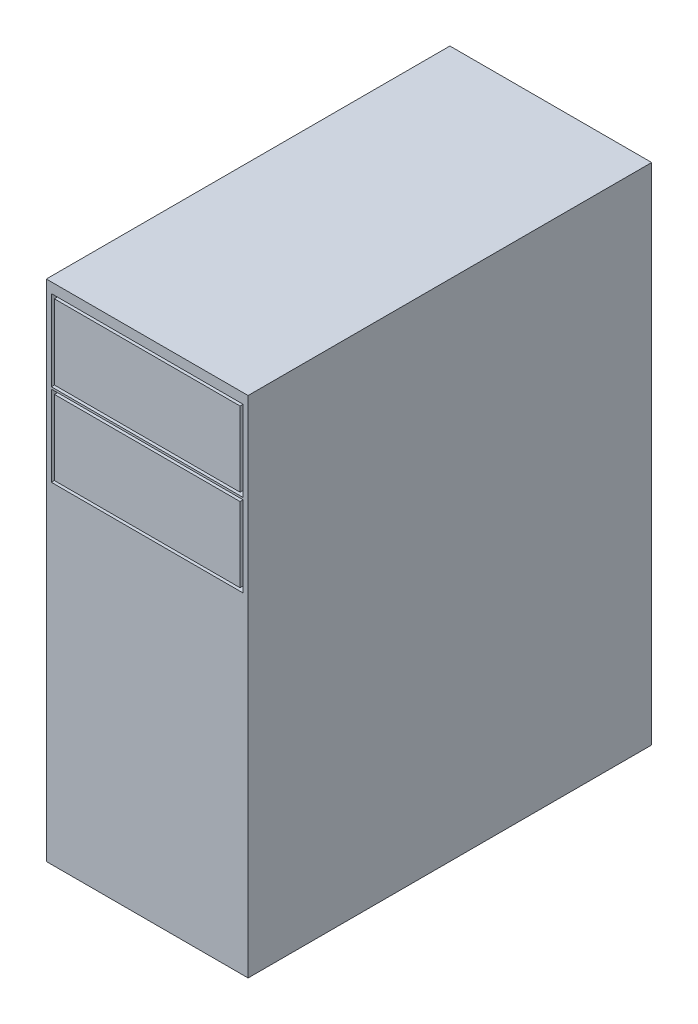
ISO-10303-21;
HEADER;
FILE_DESCRIPTION(('STEP AP214'),'2;1');
FILE_NAME('part.step','',(''),(''),'','','');
FILE_SCHEMA(('AUTOMOTIVE_DESIGN { 1 0 10303 214 1 1 1 1 }'));
ENDSEC;
DATA;
#1=APPLICATION_CONTEXT('core data for automotive mechanical design processes');
#2=APPLICATION_PROTOCOL_DEFINITION('international standard','automotive_design',2000,#1);
#3=PRODUCT_CONTEXT('',#1,'mechanical');
#4=PRODUCT('Part','Part','',(#3));
#5=PRODUCT_RELATED_PRODUCT_CATEGORY('part','',(#4));
#6=PRODUCT_DEFINITION_FORMATION('','',#4);
#7=PRODUCT_DEFINITION_CONTEXT('part definition',#1,'design');
#8=PRODUCT_DEFINITION('design','',#6,#7);
#9=PRODUCT_DEFINITION_SHAPE('','',#8);
#10=(LENGTH_UNIT() NAMED_UNIT(*) SI_UNIT(.MILLI.,.METRE.));
#11=(NAMED_UNIT(*) PLANE_ANGLE_UNIT() SI_UNIT($,.RADIAN.));
#12=(NAMED_UNIT(*) SI_UNIT($,.STERADIAN.) SOLID_ANGLE_UNIT());
#13=UNCERTAINTY_MEASURE_WITH_UNIT(LENGTH_MEASURE(1.E-05),#10,'distance_accuracy_value','');
#14=(GEOMETRIC_REPRESENTATION_CONTEXT(3) GLOBAL_UNCERTAINTY_ASSIGNED_CONTEXT((#13)) GLOBAL_UNIT_ASSIGNED_CONTEXT((#10,
#11,#12)) REPRESENTATION_CONTEXT('',''));
#15=CARTESIAN_POINT('',(0.,0.,0.));
#16=DIRECTION('',(0.,0.,1.));
#17=DIRECTION('',(1.,0.,0.));
#18=AXIS2_PLACEMENT_3D('',#15,#16,#17);
#19=CARTESIAN_POINT('',(25.,125.,-50.));
#20=DIRECTION('',(-1.,0.,0.));
#21=DIRECTION('',(0.,0.,1.));
#22=AXIS2_PLACEMENT_3D('',#19,#20,#21);
#23=PLANE('',#22);
#24=DIRECTION('',(0.,0.,-1.));
#25=VECTOR('',#24,1.);
#26=CARTESIAN_POINT('',(25.,0.,-50.));
#27=LINE('',#26,#25);
#28=CARTESIAN_POINT('',(25.,0.,50.));
#29=VERTEX_POINT('',#28);
#30=CARTESIAN_POINT('',(25.,0.,-50.));
#31=VERTEX_POINT('',#30);
#32=EDGE_CURVE('E240',#29,#31,#27,.T.);
#33=ORIENTED_EDGE('',*,*,#32,.T.);
#34=DIRECTION('',(0.,-1.,0.));
#35=VECTOR('',#34,1.);
#36=CARTESIAN_POINT('',(25.,125.,-50.));
#37=LINE('',#36,#35);
#38=CARTESIAN_POINT('',(25.,125.,-50.));
#39=VERTEX_POINT('',#38);
#40=EDGE_CURVE('E11',#39,#31,#37,.T.);
#41=ORIENTED_EDGE('',*,*,#40,.F.);
#42=DIRECTION('',(0.,0.,-1.));
#43=VECTOR('',#42,1.);
#44=CARTESIAN_POINT('',(25.,125.,-50.));
#45=LINE('',#44,#43);
#46=CARTESIAN_POINT('',(25.,125.,50.));
#47=VERTEX_POINT('',#46);
#48=EDGE_CURVE('E310',#47,#39,#45,.T.);
#49=ORIENTED_EDGE('',*,*,#48,.F.);
#50=DIRECTION('',(0.,-1.,0.));
#51=VECTOR('',#50,1.);
#52=CARTESIAN_POINT('',(25.,125.,50.));
#53=LINE('',#52,#51);
#54=EDGE_CURVE('E320',#47,#29,#53,.T.);
#55=ORIENTED_EDGE('',*,*,#54,.T.);
#56=EDGE_LOOP('',(#33,#41,#49,#55));
#57=FACE_BOUND('',#56,.T.);
#58=ADVANCED_FACE('F37',(#57),#23,.F.);
#59=CARTESIAN_POINT('',(-25.,125.,-50.));
#60=DIRECTION('',(0.,0.,1.));
#61=DIRECTION('',(1.,0.,0.));
#62=AXIS2_PLACEMENT_3D('',#59,#60,#61);
#63=PLANE('',#62);
#64=DIRECTION('',(-1.,0.,0.));
#65=VECTOR('',#64,1.);
#66=CARTESIAN_POINT('',(-25.,0.,-50.));
#67=LINE('',#66,#65);
#68=CARTESIAN_POINT('',(-25.,0.,-50.));
#69=VERTEX_POINT('',#68);
#70=EDGE_CURVE('E323',#31,#69,#67,.T.);
#71=ORIENTED_EDGE('',*,*,#70,.T.);
#72=DIRECTION('',(0.,-1.,0.));
#73=VECTOR('',#72,1.);
#74=CARTESIAN_POINT('',(-25.,125.,-50.));
#75=LINE('',#74,#73);
#76=CARTESIAN_POINT('',(-25.,125.,-50.));
#77=VERTEX_POINT('',#76);
#78=EDGE_CURVE('E44',#77,#69,#75,.T.);
#79=ORIENTED_EDGE('',*,*,#78,.F.);
#80=DIRECTION('',(-1.,0.,0.));
#81=VECTOR('',#80,1.);
#82=CARTESIAN_POINT('',(-25.,125.,-50.));
#83=LINE('',#82,#81);
#84=EDGE_CURVE('E313',#39,#77,#83,.T.);
#85=ORIENTED_EDGE('',*,*,#84,.F.);
#86=ORIENTED_EDGE('',*,*,#40,.T.);
#87=EDGE_LOOP('',(#71,#79,#85,#86));
#88=FACE_BOUND('',#87,.T.);
#89=ADVANCED_FACE('F353',(#88),#63,.F.);
#90=CARTESIAN_POINT('',(-25.,125.,-50.));
#91=DIRECTION('',(1.,0.,0.));
#92=DIRECTION('',(0.,0.,-1.));
#93=AXIS2_PLACEMENT_3D('',#90,#91,#92);
#94=PLANE('',#93);
#95=DIRECTION('',(0.,0.,1.));
#96=VECTOR('',#95,1.);
#97=CARTESIAN_POINT('',(-25.,0.,-50.));
#98=LINE('',#97,#96);
#99=CARTESIAN_POINT('',(-25.,0.,50.));
#100=VERTEX_POINT('',#99);
#101=EDGE_CURVE('E325',#69,#100,#98,.T.);
#102=ORIENTED_EDGE('',*,*,#101,.T.);
#103=DIRECTION('',(0.,-1.,0.));
#104=VECTOR('',#103,1.);
#105=CARTESIAN_POINT('',(-25.,125.,50.));
#106=LINE('',#105,#104);
#107=CARTESIAN_POINT('',(-25.,125.,50.));
#108=VERTEX_POINT('',#107);
#109=EDGE_CURVE('E330',#108,#100,#106,.T.);
#110=ORIENTED_EDGE('',*,*,#109,.F.);
#111=DIRECTION('',(0.,0.,1.));
#112=VECTOR('',#111,1.);
#113=CARTESIAN_POINT('',(-25.,125.,-50.));
#114=LINE('',#113,#112);
#115=EDGE_CURVE('E316',#77,#108,#114,.T.);
#116=ORIENTED_EDGE('',*,*,#115,.F.);
#117=ORIENTED_EDGE('',*,*,#78,.T.);
#118=EDGE_LOOP('',(#102,#110,#116,#117));
#119=FACE_BOUND('',#118,.T.);
#120=ADVANCED_FACE('F337',(#119),#94,.F.);
#121=CARTESIAN_POINT('',(-25.,125.,50.));
#122=DIRECTION('',(0.,0.,-1.));
#123=DIRECTION('',(-1.,0.,0.));
#124=AXIS2_PLACEMENT_3D('',#121,#122,#123);
#125=PLANE('',#124);
#126=DIRECTION('',(-1.,0.,0.));
#127=VECTOR('',#126,1.);
#128=CARTESIAN_POINT('',(-23.75,122.5,50.));
#129=LINE('',#128,#127);
#130=CARTESIAN_POINT('',(23.75,122.5,50.));
#131=VERTEX_POINT('',#130);
#132=CARTESIAN_POINT('',(-23.75,122.5,50.));
#133=VERTEX_POINT('',#132);
#134=EDGE_CURVE('E230',#131,#133,#129,.T.);
#135=ORIENTED_EDGE('',*,*,#134,.F.);
#136=DIRECTION('',(0.,1.,0.));
#137=VECTOR('',#136,1.);
#138=CARTESIAN_POINT('',(23.75,122.5,50.));
#139=LINE('',#138,#137);
#140=CARTESIAN_POINT('',(23.75,102.5,50.));
#141=VERTEX_POINT('',#140);
#142=EDGE_CURVE('E51',#141,#131,#139,.T.);
#143=ORIENTED_EDGE('',*,*,#142,.F.);
#144=DIRECTION('',(1.,0.,0.));
#145=VECTOR('',#144,1.);
#146=CARTESIAN_POINT('',(-23.75,102.5,50.));
#147=LINE('',#146,#145);
#148=CARTESIAN_POINT('',(-23.75,102.5,50.));
#149=VERTEX_POINT('',#148);
#150=EDGE_CURVE('E219',#149,#141,#147,.T.);
#151=ORIENTED_EDGE('',*,*,#150,.F.);
#152=DIRECTION('',(0.,-1.,0.));
#153=VECTOR('',#152,1.);
#154=CARTESIAN_POINT('',(-23.75,122.5,50.));
#155=LINE('',#154,#153);
#156=EDGE_CURVE('E233',#133,#149,#155,.T.);
#157=ORIENTED_EDGE('',*,*,#156,.F.);
#158=EDGE_LOOP('',(#135,#143,#151,#157));
#159=FACE_BOUND('',#158,.T.);
#160=DIRECTION('',(-1.,0.,0.));
#161=VECTOR('',#160,1.);
#162=CARTESIAN_POINT('',(-23.7499999999998,102.,50.));
#163=LINE('',#162,#161);
#164=CARTESIAN_POINT('',(23.7500000000002,102.,50.));
#165=VERTEX_POINT('',#164);
#166=CARTESIAN_POINT('',(-23.7499999999998,102.,50.));
#167=VERTEX_POINT('',#166);
#168=EDGE_CURVE('E295',#165,#167,#163,.T.);
#169=ORIENTED_EDGE('',*,*,#168,.F.);
#170=DIRECTION('',(0.,1.,0.));
#171=VECTOR('',#170,1.);
#172=CARTESIAN_POINT('',(23.7500000000002,102.,50.));
#173=LINE('',#172,#171);
#174=CARTESIAN_POINT('',(23.7500000000002,82.,50.));
#175=VERTEX_POINT('',#174);
#176=EDGE_CURVE('E273',#175,#165,#173,.T.);
#177=ORIENTED_EDGE('',*,*,#176,.F.);
#178=DIRECTION('',(1.,0.,0.));
#179=VECTOR('',#178,1.);
#180=CARTESIAN_POINT('',(-23.7499999999998,82.,50.));
#181=LINE('',#180,#179);
#182=CARTESIAN_POINT('',(-23.7499999999998,82.,50.));
#183=VERTEX_POINT('',#182);
#184=EDGE_CURVE('E284',#183,#175,#181,.T.);
#185=ORIENTED_EDGE('',*,*,#184,.F.);
#186=DIRECTION('',(0.,-1.,0.));
#187=VECTOR('',#186,1.);
#188=CARTESIAN_POINT('',(-23.7499999999998,102.,50.));
#189=LINE('',#188,#187);
#190=EDGE_CURVE('E298',#167,#183,#189,.T.);
#191=ORIENTED_EDGE('',*,*,#190,.F.);
#192=EDGE_LOOP('',(#169,#177,#185,#191));
#193=FACE_BOUND('',#192,.T.);
#194=DIRECTION('',(1.,0.,0.));
#195=VECTOR('',#194,1.);
#196=CARTESIAN_POINT('',(-25.,0.,50.));
#197=LINE('',#196,#195);
#198=EDGE_CURVE('E314',#100,#29,#197,.T.);
#199=ORIENTED_EDGE('',*,*,#198,.T.);
#200=ORIENTED_EDGE('',*,*,#54,.F.);
#201=DIRECTION('',(1.,0.,0.));
#202=VECTOR('',#201,1.);
#203=CARTESIAN_POINT('',(-25.,125.,50.));
#204=LINE('',#203,#202);
#205=EDGE_CURVE('E318',#108,#47,#204,.T.);
#206=ORIENTED_EDGE('',*,*,#205,.F.);
#207=ORIENTED_EDGE('',*,*,#109,.T.);
#208=EDGE_LOOP('',(#199,#200,#206,#207));
#209=FACE_BOUND('',#208,.T.);
#210=ADVANCED_FACE('F346',(#159,#193,#209),#125,.F.);
#211=CARTESIAN_POINT('',(0.,125.,0.));
#212=DIRECTION('',(0.,1.,0.));
#213=DIRECTION('',(0.,0.,1.));
#214=AXIS2_PLACEMENT_3D('',#211,#212,#213);
#215=PLANE('',#214);
#216=ORIENTED_EDGE('',*,*,#48,.T.);
#217=ORIENTED_EDGE('',*,*,#84,.T.);
#218=ORIENTED_EDGE('',*,*,#115,.T.);
#219=ORIENTED_EDGE('',*,*,#205,.T.);
#220=EDGE_LOOP('',(#216,#217,#218,#219));
#221=FACE_BOUND('',#220,.T.);
#222=ADVANCED_FACE('F352',(#221),#215,.T.);
#223=CARTESIAN_POINT('',(0.,0.,0.));
#224=DIRECTION('',(0.,1.,0.));
#225=DIRECTION('',(0.,0.,1.));
#226=AXIS2_PLACEMENT_3D('',#223,#224,#225);
#227=PLANE('',#226);
#228=ORIENTED_EDGE('',*,*,#32,.F.);
#229=ORIENTED_EDGE('',*,*,#198,.F.);
#230=ORIENTED_EDGE('',*,*,#101,.F.);
#231=ORIENTED_EDGE('',*,*,#70,.F.);
#232=EDGE_LOOP('',(#228,#229,#230,#231));
#233=FACE_BOUND('',#232,.T.);
#234=ADVANCED_FACE('F343',(#233),#227,.F.);
#235=CARTESIAN_POINT('',(23.7500000000002,102.,48.));
#236=DIRECTION('',(1.,0.,0.));
#237=DIRECTION('',(0.,1.,0.));
#238=AXIS2_PLACEMENT_3D('',#235,#236,#237);
#239=PLANE('',#238);
#240=ORIENTED_EDGE('',*,*,#176,.T.);
#241=DIRECTION('',(0.,0.,1.));
#242=VECTOR('',#241,1.);
#243=CARTESIAN_POINT('',(23.7500000000002,102.,48.));
#244=LINE('',#243,#242);
#245=CARTESIAN_POINT('',(23.7500000000002,102.,48.));
#246=VERTEX_POINT('',#245);
#247=EDGE_CURVE('E293',#246,#165,#244,.T.);
#248=ORIENTED_EDGE('',*,*,#247,.F.);
#249=DIRECTION('',(0.,1.,0.));
#250=VECTOR('',#249,1.);
#251=CARTESIAN_POINT('',(23.7500000000002,102.,48.));
#252=LINE('',#251,#250);
#253=CARTESIAN_POINT('',(23.7500000000002,82.,48.));
#254=VERTEX_POINT('',#253);
#255=EDGE_CURVE('E280',#254,#246,#252,.T.);
#256=ORIENTED_EDGE('',*,*,#255,.F.);
#257=DIRECTION('',(0.,0.,1.));
#258=VECTOR('',#257,1.);
#259=CARTESIAN_POINT('',(23.7500000000002,82.,48.));
#260=LINE('',#259,#258);
#261=EDGE_CURVE('E208',#254,#175,#260,.T.);
#262=ORIENTED_EDGE('',*,*,#261,.T.);
#263=EDGE_LOOP('',(#240,#248,#256,#262));
#264=FACE_BOUND('',#263,.T.);
#265=ADVANCED_FACE('F368',(#264),#239,.F.);
#266=CARTESIAN_POINT('',(-23.7499999999998,82.,48.));
#267=DIRECTION('',(0.,-1.,0.));
#268=DIRECTION('',(0.,0.,-1.));
#269=AXIS2_PLACEMENT_3D('',#266,#267,#268);
#270=PLANE('',#269);
#271=ORIENTED_EDGE('',*,*,#184,.T.);
#272=ORIENTED_EDGE('',*,*,#261,.F.);
#273=DIRECTION('',(1.,0.,0.));
#274=VECTOR('',#273,1.);
#275=CARTESIAN_POINT('',(-23.7499999999998,82.,48.));
#276=LINE('',#275,#274);
#277=CARTESIAN_POINT('',(-23.7499999999998,82.,48.));
#278=VERTEX_POINT('',#277);
#279=EDGE_CURVE('E290',#278,#254,#276,.T.);
#280=ORIENTED_EDGE('',*,*,#279,.F.);
#281=DIRECTION('',(0.,0.,1.));
#282=VECTOR('',#281,1.);
#283=CARTESIAN_POINT('',(-23.7499999999998,82.,48.));
#284=LINE('',#283,#282);
#285=EDGE_CURVE('E304',#278,#183,#284,.T.);
#286=ORIENTED_EDGE('',*,*,#285,.T.);
#287=EDGE_LOOP('',(#271,#272,#280,#286));
#288=FACE_BOUND('',#287,.T.);
#289=ADVANCED_FACE('F373',(#288),#270,.F.);
#290=CARTESIAN_POINT('',(-23.7499999999998,102.,48.));
#291=DIRECTION('',(-1.,0.,0.));
#292=DIRECTION('',(0.,-1.,0.));
#293=AXIS2_PLACEMENT_3D('',#290,#291,#292);
#294=PLANE('',#293);
#295=ORIENTED_EDGE('',*,*,#190,.T.);
#296=ORIENTED_EDGE('',*,*,#285,.F.);
#297=DIRECTION('',(0.,-1.,0.));
#298=VECTOR('',#297,1.);
#299=CARTESIAN_POINT('',(-23.7499999999998,102.,48.));
#300=LINE('',#299,#298);
#301=CARTESIAN_POINT('',(-23.7499999999998,102.,48.));
#302=VERTEX_POINT('',#301);
#303=EDGE_CURVE('E287',#302,#278,#300,.T.);
#304=ORIENTED_EDGE('',*,*,#303,.F.);
#305=DIRECTION('',(0.,0.,1.));
#306=VECTOR('',#305,1.);
#307=CARTESIAN_POINT('',(-23.7499999999998,102.,48.));
#308=LINE('',#307,#306);
#309=EDGE_CURVE('E306',#302,#167,#308,.T.);
#310=ORIENTED_EDGE('',*,*,#309,.T.);
#311=EDGE_LOOP('',(#295,#296,#304,#310));
#312=FACE_BOUND('',#311,.T.);
#313=ADVANCED_FACE('F379',(#312),#294,.F.);
#314=CARTESIAN_POINT('',(-23.7499999999998,102.,48.));
#315=DIRECTION('',(0.,1.,0.));
#316=DIRECTION('',(-1.,0.,0.));
#317=AXIS2_PLACEMENT_3D('',#314,#315,#316);
#318=PLANE('',#317);
#319=ORIENTED_EDGE('',*,*,#168,.T.);
#320=ORIENTED_EDGE('',*,*,#309,.F.);
#321=DIRECTION('',(-1.,0.,0.));
#322=VECTOR('',#321,1.);
#323=CARTESIAN_POINT('',(-23.7499999999998,102.,48.));
#324=LINE('',#323,#322);
#325=EDGE_CURVE('E283',#246,#302,#324,.T.);
#326=ORIENTED_EDGE('',*,*,#325,.F.);
#327=ORIENTED_EDGE('',*,*,#247,.T.);
#328=EDGE_LOOP('',(#319,#320,#326,#327));
#329=FACE_BOUND('',#328,.T.);
#330=ADVANCED_FACE('F375',(#329),#318,.F.);
#331=CARTESIAN_POINT('',(0.,0.,48.));
#332=DIRECTION('',(0.,0.,1.));
#333=DIRECTION('',(1.,0.,0.));
#334=AXIS2_PLACEMENT_3D('',#331,#332,#333);
#335=PLANE('',#334);
#336=DIRECTION('',(1.,0.,0.));
#337=VECTOR('',#336,1.);
#338=CARTESIAN_POINT('',(-22.9999999999998,82.75,48.));
#339=LINE('',#338,#337);
#340=CARTESIAN_POINT('',(-22.9999999999998,82.75,48.));
#341=VERTEX_POINT('',#340);
#342=CARTESIAN_POINT('',(23.0000000000002,82.75,48.));
#343=VERTEX_POINT('',#342);
#344=EDGE_CURVE('E256',#341,#343,#339,.T.);
#345=ORIENTED_EDGE('',*,*,#344,.F.);
#346=DIRECTION('',(0.,-1.,0.));
#347=VECTOR('',#346,1.);
#348=CARTESIAN_POINT('',(-22.9999999999998,101.25,48.));
#349=LINE('',#348,#347);
#350=CARTESIAN_POINT('',(-22.9999999999998,101.25,48.));
#351=VERTEX_POINT('',#350);
#352=EDGE_CURVE('E253',#351,#341,#349,.T.);
#353=ORIENTED_EDGE('',*,*,#352,.F.);
#354=DIRECTION('',(-1.,0.,0.));
#355=VECTOR('',#354,1.);
#356=CARTESIAN_POINT('',(-22.9999999999998,101.25,48.));
#357=LINE('',#356,#355);
#358=CARTESIAN_POINT('',(23.0000000000002,101.25,48.));
#359=VERTEX_POINT('',#358);
#360=EDGE_CURVE('E249',#359,#351,#357,.T.);
#361=ORIENTED_EDGE('',*,*,#360,.F.);
#362=DIRECTION('',(0.,1.,0.));
#363=VECTOR('',#362,1.);
#364=CARTESIAN_POINT('',(23.0000000000002,101.25,48.));
#365=LINE('',#364,#363);
#366=EDGE_CURVE('E246',#343,#359,#365,.T.);
#367=ORIENTED_EDGE('',*,*,#366,.F.);
#368=EDGE_LOOP('',(#345,#353,#361,#367));
#369=FACE_BOUND('',#368,.T.);
#370=ORIENTED_EDGE('',*,*,#255,.T.);
#371=ORIENTED_EDGE('',*,*,#325,.T.);
#372=ORIENTED_EDGE('',*,*,#303,.T.);
#373=ORIENTED_EDGE('',*,*,#279,.T.);
#374=EDGE_LOOP('',(#370,#371,#372,#373));
#375=FACE_BOUND('',#374,.T.);
#376=ADVANCED_FACE('F378',(#369,#375),#335,.T.);
#377=CARTESIAN_POINT('',(23.0000000000002,101.25,48.));
#378=DIRECTION('',(1.,0.,0.));
#379=DIRECTION('',(0.,1.,0.));
#380=AXIS2_PLACEMENT_3D('',#377,#378,#379);
#381=PLANE('',#380);
#382=DIRECTION('',(0.,1.,0.));
#383=VECTOR('',#382,1.);
#384=CARTESIAN_POINT('',(23.0000000000002,101.25,50.));
#385=LINE('',#384,#383);
#386=CARTESIAN_POINT('',(23.0000000000002,82.75,50.));
#387=VERTEX_POINT('',#386);
#388=CARTESIAN_POINT('',(23.0000000000002,101.25,50.));
#389=VERTEX_POINT('',#388);
#390=EDGE_CURVE('E260',#387,#389,#385,.T.);
#391=ORIENTED_EDGE('',*,*,#390,.F.);
#392=DIRECTION('',(0.,0.,1.));
#393=VECTOR('',#392,1.);
#394=CARTESIAN_POINT('',(23.0000000000002,82.75,48.));
#395=LINE('',#394,#393);
#396=EDGE_CURVE('E271',#343,#387,#395,.T.);
#397=ORIENTED_EDGE('',*,*,#396,.F.);
#398=ORIENTED_EDGE('',*,*,#366,.T.);
#399=DIRECTION('',(0.,0.,1.));
#400=VECTOR('',#399,1.);
#401=CARTESIAN_POINT('',(23.0000000000002,101.25,48.));
#402=LINE('',#401,#400);
#403=EDGE_CURVE('E259',#359,#389,#402,.T.);
#404=ORIENTED_EDGE('',*,*,#403,.T.);
#405=EDGE_LOOP('',(#391,#397,#398,#404));
#406=FACE_BOUND('',#405,.T.);
#407=ADVANCED_FACE('F389',(#406),#381,.T.);
#408=CARTESIAN_POINT('',(-22.9999999999998,82.75,48.));
#409=DIRECTION('',(0.,-1.,0.));
#410=DIRECTION('',(0.,0.,-1.));
#411=AXIS2_PLACEMENT_3D('',#408,#409,#410);
#412=PLANE('',#411);
#413=DIRECTION('',(1.,0.,0.));
#414=VECTOR('',#413,1.);
#415=CARTESIAN_POINT('',(-22.9999999999998,82.75,50.));
#416=LINE('',#415,#414);
#417=CARTESIAN_POINT('',(-22.9999999999998,82.75,50.));
#418=VERTEX_POINT('',#417);
#419=EDGE_CURVE('E250',#418,#387,#416,.T.);
#420=ORIENTED_EDGE('',*,*,#419,.F.);
#421=DIRECTION('',(0.,0.,1.));
#422=VECTOR('',#421,1.);
#423=CARTESIAN_POINT('',(-22.9999999999998,82.75,48.));
#424=LINE('',#423,#422);
#425=EDGE_CURVE('E274',#341,#418,#424,.T.);
#426=ORIENTED_EDGE('',*,*,#425,.F.);
#427=ORIENTED_EDGE('',*,*,#344,.T.);
#428=ORIENTED_EDGE('',*,*,#396,.T.);
#429=EDGE_LOOP('',(#420,#426,#427,#428));
#430=FACE_BOUND('',#429,.T.);
#431=ADVANCED_FACE('F393',(#430),#412,.T.);
#432=CARTESIAN_POINT('',(-22.9999999999998,101.25,48.));
#433=DIRECTION('',(-1.,0.,0.));
#434=DIRECTION('',(0.,0.,1.));
#435=AXIS2_PLACEMENT_3D('',#432,#433,#434);
#436=PLANE('',#435);
#437=DIRECTION('',(0.,-1.,0.));
#438=VECTOR('',#437,1.);
#439=CARTESIAN_POINT('',(-22.9999999999998,101.25,50.));
#440=LINE('',#439,#438);
#441=CARTESIAN_POINT('',(-22.9999999999998,101.25,50.));
#442=VERTEX_POINT('',#441);
#443=EDGE_CURVE('E266',#442,#418,#440,.T.);
#444=ORIENTED_EDGE('',*,*,#443,.F.);
#445=DIRECTION('',(0.,0.,1.));
#446=VECTOR('',#445,1.);
#447=CARTESIAN_POINT('',(-22.9999999999998,101.25,48.));
#448=LINE('',#447,#446);
#449=EDGE_CURVE('E276',#351,#442,#448,.T.);
#450=ORIENTED_EDGE('',*,*,#449,.F.);
#451=ORIENTED_EDGE('',*,*,#352,.T.);
#452=ORIENTED_EDGE('',*,*,#425,.T.);
#453=EDGE_LOOP('',(#444,#450,#451,#452));
#454=FACE_BOUND('',#453,.T.);
#455=ADVANCED_FACE('F399',(#454),#436,.T.);
#456=CARTESIAN_POINT('',(-22.9999999999998,101.25,48.));
#457=DIRECTION('',(0.,1.,0.));
#458=DIRECTION('',(0.,0.,1.));
#459=AXIS2_PLACEMENT_3D('',#456,#457,#458);
#460=PLANE('',#459);
#461=DIRECTION('',(-1.,0.,0.));
#462=VECTOR('',#461,1.);
#463=CARTESIAN_POINT('',(-22.9999999999998,101.25,50.));
#464=LINE('',#463,#462);
#465=EDGE_CURVE('E263',#389,#442,#464,.T.);
#466=ORIENTED_EDGE('',*,*,#465,.F.);
#467=ORIENTED_EDGE('',*,*,#403,.F.);
#468=ORIENTED_EDGE('',*,*,#360,.T.);
#469=ORIENTED_EDGE('',*,*,#449,.T.);
#470=EDGE_LOOP('',(#466,#467,#468,#469));
#471=FACE_BOUND('',#470,.T.);
#472=ADVANCED_FACE('F395',(#471),#460,.T.);
#473=CARTESIAN_POINT('',(23.75,122.5,48.));
#474=DIRECTION('',(1.,0.,0.));
#475=DIRECTION('',(0.,1.,0.));
#476=AXIS2_PLACEMENT_3D('',#473,#474,#475);
#477=PLANE('',#476);
#478=ORIENTED_EDGE('',*,*,#142,.T.);
#479=DIRECTION('',(0.,0.,1.));
#480=VECTOR('',#479,1.);
#481=CARTESIAN_POINT('',(23.75,122.5,48.));
#482=LINE('',#481,#480);
#483=CARTESIAN_POINT('',(23.75,122.5,48.));
#484=VERTEX_POINT('',#483);
#485=EDGE_CURVE('E228',#484,#131,#482,.T.);
#486=ORIENTED_EDGE('',*,*,#485,.F.);
#487=DIRECTION('',(0.,1.,0.));
#488=VECTOR('',#487,1.);
#489=CARTESIAN_POINT('',(23.75,122.5,48.));
#490=LINE('',#489,#488);
#491=CARTESIAN_POINT('',(23.75,102.5,48.));
#492=VERTEX_POINT('',#491);
#493=EDGE_CURVE('E215',#492,#484,#490,.T.);
#494=ORIENTED_EDGE('',*,*,#493,.F.);
#495=DIRECTION('',(0.,0.,1.));
#496=VECTOR('',#495,1.);
#497=CARTESIAN_POINT('',(23.75,102.5,48.));
#498=LINE('',#497,#496);
#499=EDGE_CURVE('E238',#492,#141,#498,.T.);
#500=ORIENTED_EDGE('',*,*,#499,.T.);
#501=EDGE_LOOP('',(#478,#486,#494,#500));
#502=FACE_BOUND('',#501,.T.);
#503=ADVANCED_FACE('F398',(#502),#477,.F.);
#504=CARTESIAN_POINT('',(-23.75,102.5,48.));
#505=DIRECTION('',(0.,-1.,0.));
#506=DIRECTION('',(0.,0.,-1.));
#507=AXIS2_PLACEMENT_3D('',#504,#505,#506);
#508=PLANE('',#507);
#509=ORIENTED_EDGE('',*,*,#150,.T.);
#510=ORIENTED_EDGE('',*,*,#499,.F.);
#511=DIRECTION('',(1.,0.,0.));
#512=VECTOR('',#511,1.);
#513=CARTESIAN_POINT('',(-23.75,102.5,48.));
#514=LINE('',#513,#512);
#515=CARTESIAN_POINT('',(-23.75,102.5,48.));
#516=VERTEX_POINT('',#515);
#517=EDGE_CURVE('E225',#516,#492,#514,.T.);
#518=ORIENTED_EDGE('',*,*,#517,.F.);
#519=DIRECTION('',(0.,0.,1.));
#520=VECTOR('',#519,1.);
#521=CARTESIAN_POINT('',(-23.75,102.5,48.));
#522=LINE('',#521,#520);
#523=EDGE_CURVE('E241',#516,#149,#522,.T.);
#524=ORIENTED_EDGE('',*,*,#523,.T.);
#525=EDGE_LOOP('',(#509,#510,#518,#524));
#526=FACE_BOUND('',#525,.T.);
#527=ADVANCED_FACE('F409',(#526),#508,.F.);
#528=CARTESIAN_POINT('',(-23.75,122.5,48.));
#529=DIRECTION('',(-1.,0.,0.));
#530=DIRECTION('',(0.,-1.,0.));
#531=AXIS2_PLACEMENT_3D('',#528,#529,#530);
#532=PLANE('',#531);
#533=ORIENTED_EDGE('',*,*,#156,.T.);
#534=ORIENTED_EDGE('',*,*,#523,.F.);
#535=DIRECTION('',(0.,-1.,0.));
#536=VECTOR('',#535,1.);
#537=CARTESIAN_POINT('',(-23.75,122.5,48.));
#538=LINE('',#537,#536);
#539=CARTESIAN_POINT('',(-23.75,122.5,48.));
#540=VERTEX_POINT('',#539);
#541=EDGE_CURVE('E222',#540,#516,#538,.T.);
#542=ORIENTED_EDGE('',*,*,#541,.F.);
#543=DIRECTION('',(0.,0.,1.));
#544=VECTOR('',#543,1.);
#545=CARTESIAN_POINT('',(-23.75,122.5,48.));
#546=LINE('',#545,#544);
#547=EDGE_CURVE('E243',#540,#133,#546,.T.);
#548=ORIENTED_EDGE('',*,*,#547,.T.);
#549=EDGE_LOOP('',(#533,#534,#542,#548));
#550=FACE_BOUND('',#549,.T.);
#551=ADVANCED_FACE('F413',(#550),#532,.F.);
#552=CARTESIAN_POINT('',(-23.75,122.5,48.));
#553=DIRECTION('',(0.,1.,0.));
#554=DIRECTION('',(-1.,0.,0.));
#555=AXIS2_PLACEMENT_3D('',#552,#553,#554);
#556=PLANE('',#555);
#557=ORIENTED_EDGE('',*,*,#134,.T.);
#558=ORIENTED_EDGE('',*,*,#547,.F.);
#559=DIRECTION('',(-1.,0.,0.));
#560=VECTOR('',#559,1.);
#561=CARTESIAN_POINT('',(-23.75,122.5,48.));
#562=LINE('',#561,#560);
#563=EDGE_CURVE('E218',#484,#540,#562,.T.);
#564=ORIENTED_EDGE('',*,*,#563,.F.);
#565=ORIENTED_EDGE('',*,*,#485,.T.);
#566=EDGE_LOOP('',(#557,#558,#564,#565));
#567=FACE_BOUND('',#566,.T.);
#568=ADVANCED_FACE('F410',(#567),#556,.F.);
#569=CARTESIAN_POINT('',(0.,0.,48.));
#570=DIRECTION('',(0.,0.,1.));
#571=DIRECTION('',(1.,0.,0.));
#572=AXIS2_PLACEMENT_3D('',#569,#570,#571);
#573=PLANE('',#572);
#574=DIRECTION('',(1.,0.,0.));
#575=VECTOR('',#574,1.);
#576=CARTESIAN_POINT('',(-23.,103.25,48.));
#577=LINE('',#576,#575);
#578=CARTESIAN_POINT('',(-23.,103.25,48.));
#579=VERTEX_POINT('',#578);
#580=CARTESIAN_POINT('',(23.,103.25,48.));
#581=VERTEX_POINT('',#580);
#582=EDGE_CURVE('E185',#579,#581,#577,.T.);
#583=ORIENTED_EDGE('',*,*,#582,.F.);
#584=DIRECTION('',(0.,-1.,0.));
#585=VECTOR('',#584,1.);
#586=CARTESIAN_POINT('',(-23.,121.75,48.));
#587=LINE('',#586,#585);
#588=CARTESIAN_POINT('',(-23.,121.75,48.));
#589=VERTEX_POINT('',#588);
#590=EDGE_CURVE('E195',#589,#579,#587,.T.);
#591=ORIENTED_EDGE('',*,*,#590,.F.);
#592=DIRECTION('',(-1.,0.,0.));
#593=VECTOR('',#592,1.);
#594=CARTESIAN_POINT('',(-23.,121.75,48.));
#595=LINE('',#594,#593);
#596=CARTESIAN_POINT('',(23.,121.75,48.));
#597=VERTEX_POINT('',#596);
#598=EDGE_CURVE('E177',#597,#589,#595,.T.);
#599=ORIENTED_EDGE('',*,*,#598,.F.);
#600=DIRECTION('',(0.,1.,0.));
#601=VECTOR('',#600,1.);
#602=CARTESIAN_POINT('',(23.,121.75,48.));
#603=LINE('',#602,#601);
#604=EDGE_CURVE('E192',#581,#597,#603,.T.);
#605=ORIENTED_EDGE('',*,*,#604,.F.);
#606=EDGE_LOOP('',(#583,#591,#599,#605));
#607=FACE_BOUND('',#606,.T.);
#608=ORIENTED_EDGE('',*,*,#493,.T.);
#609=ORIENTED_EDGE('',*,*,#563,.T.);
#610=ORIENTED_EDGE('',*,*,#541,.T.);
#611=ORIENTED_EDGE('',*,*,#517,.T.);
#612=EDGE_LOOP('',(#608,#609,#610,#611));
#613=FACE_BOUND('',#612,.T.);
#614=ADVANCED_FACE('F190',(#607,#613),#573,.T.);
#615=CARTESIAN_POINT('',(23.,121.75,48.));
#616=DIRECTION('',(1.,0.,0.));
#617=DIRECTION('',(0.,1.,0.));
#618=AXIS2_PLACEMENT_3D('',#615,#616,#617);
#619=PLANE('',#618);
#620=DIRECTION('',(0.,1.,0.));
#621=VECTOR('',#620,1.);
#622=CARTESIAN_POINT('',(23.,121.75,50.));
#623=LINE('',#622,#621);
#624=CARTESIAN_POINT('',(23.,103.25,50.));
#625=VERTEX_POINT('',#624);
#626=CARTESIAN_POINT('',(23.,121.75,50.));
#627=VERTEX_POINT('',#626);
#628=EDGE_CURVE('E206',#625,#627,#623,.T.);
#629=ORIENTED_EDGE('',*,*,#628,.F.);
#630=DIRECTION('',(0.,0.,1.));
#631=VECTOR('',#630,1.);
#632=CARTESIAN_POINT('',(23.,103.25,48.));
#633=LINE('',#632,#631);
#634=EDGE_CURVE('E198',#581,#625,#633,.T.);
#635=ORIENTED_EDGE('',*,*,#634,.F.);
#636=ORIENTED_EDGE('',*,*,#604,.T.);
#637=DIRECTION('',(0.,0.,1.));
#638=VECTOR('',#637,1.);
#639=CARTESIAN_POINT('',(23.,121.75,48.));
#640=LINE('',#639,#638);
#641=EDGE_CURVE('E174',#597,#627,#640,.T.);
#642=ORIENTED_EDGE('',*,*,#641,.T.);
#643=EDGE_LOOP('',(#629,#635,#636,#642));
#644=FACE_BOUND('',#643,.T.);
#645=ADVANCED_FACE('F197',(#644),#619,.T.);
#646=CARTESIAN_POINT('',(-23.,103.25,48.));
#647=DIRECTION('',(0.,-1.,0.));
#648=DIRECTION('',(0.,0.,-1.));
#649=AXIS2_PLACEMENT_3D('',#646,#647,#648);
#650=PLANE('',#649);
#651=DIRECTION('',(1.,0.,0.));
#652=VECTOR('',#651,1.);
#653=CARTESIAN_POINT('',(-23.,103.25,50.));
#654=LINE('',#653,#652);
#655=CARTESIAN_POINT('',(-23.,103.25,50.));
#656=VERTEX_POINT('',#655);
#657=EDGE_CURVE('E199',#656,#625,#654,.T.);
#658=ORIENTED_EDGE('',*,*,#657,.F.);
#659=DIRECTION('',(0.,0.,1.));
#660=VECTOR('',#659,1.);
#661=CARTESIAN_POINT('',(-23.,103.25,48.));
#662=LINE('',#661,#660);
#663=EDGE_CURVE('E212',#579,#656,#662,.T.);
#664=ORIENTED_EDGE('',*,*,#663,.F.);
#665=ORIENTED_EDGE('',*,*,#582,.T.);
#666=ORIENTED_EDGE('',*,*,#634,.T.);
#667=EDGE_LOOP('',(#658,#664,#665,#666));
#668=FACE_BOUND('',#667,.T.);
#669=ADVANCED_FACE('F425',(#668),#650,.T.);
#670=CARTESIAN_POINT('',(-23.,121.75,48.));
#671=DIRECTION('',(-1.,0.,0.));
#672=DIRECTION('',(0.,0.,1.));
#673=AXIS2_PLACEMENT_3D('',#670,#671,#672);
#674=PLANE('',#673);
#675=DIRECTION('',(0.,-1.,0.));
#676=VECTOR('',#675,1.);
#677=CARTESIAN_POINT('',(-23.,121.75,50.));
#678=LINE('',#677,#676);
#679=CARTESIAN_POINT('',(-23.,121.75,50.));
#680=VERTEX_POINT('',#679);
#681=EDGE_CURVE('E59',#680,#656,#678,.T.);
#682=ORIENTED_EDGE('',*,*,#681,.F.);
#683=DIRECTION('',(0.,0.,1.));
#684=VECTOR('',#683,1.);
#685=CARTESIAN_POINT('',(-23.,121.75,48.));
#686=LINE('',#685,#684);
#687=EDGE_CURVE('E184',#589,#680,#686,.T.);
#688=ORIENTED_EDGE('',*,*,#687,.F.);
#689=ORIENTED_EDGE('',*,*,#590,.T.);
#690=ORIENTED_EDGE('',*,*,#663,.T.);
#691=EDGE_LOOP('',(#682,#688,#689,#690));
#692=FACE_BOUND('',#691,.T.);
#693=ADVANCED_FACE('F428',(#692),#674,.T.);
#694=CARTESIAN_POINT('',(-23.,121.75,48.));
#695=DIRECTION('',(0.,1.,0.));
#696=DIRECTION('',(0.,0.,1.));
#697=AXIS2_PLACEMENT_3D('',#694,#695,#696);
#698=PLANE('',#697);
#699=DIRECTION('',(-1.,0.,0.));
#700=VECTOR('',#699,1.);
#701=CARTESIAN_POINT('',(-23.,121.75,50.));
#702=LINE('',#701,#700);
#703=EDGE_CURVE('E179',#627,#680,#702,.T.);
#704=ORIENTED_EDGE('',*,*,#703,.F.);
#705=ORIENTED_EDGE('',*,*,#641,.F.);
#706=ORIENTED_EDGE('',*,*,#598,.T.);
#707=ORIENTED_EDGE('',*,*,#687,.T.);
#708=EDGE_LOOP('',(#704,#705,#706,#707));
#709=FACE_BOUND('',#708,.T.);
#710=ADVANCED_FACE('F176',(#709),#698,.T.);
#711=ORIENTED_EDGE('',*,*,#390,.T.);
#712=ORIENTED_EDGE('',*,*,#465,.T.);
#713=ORIENTED_EDGE('',*,*,#443,.T.);
#714=ORIENTED_EDGE('',*,*,#419,.T.);
#715=EDGE_LOOP('',(#711,#712,#713,#714));
#716=FACE_BOUND('',#715,.T.);
#717=ADVANCED_FACE('F365',(#716),#125,.F.);
#718=ORIENTED_EDGE('',*,*,#628,.T.);
#719=ORIENTED_EDGE('',*,*,#703,.T.);
#720=ORIENTED_EDGE('',*,*,#681,.T.);
#721=ORIENTED_EDGE('',*,*,#657,.T.);
#722=EDGE_LOOP('',(#718,#719,#720,#721));
#723=FACE_BOUND('',#722,.T.);
#724=ADVANCED_FACE('F364',(#723),#125,.F.);
#725=CLOSED_SHELL('',(#58,#89,#120,#210,#222,#234,#265,#289,#313,#330,#376,#407,#431,#455,#472,
#503,#527,#551,#568,#614,#645,#669,#693,#710,#717,#724));
#726=MANIFOLD_SOLID_BREP('B2',#725);
#727=ADVANCED_BREP_SHAPE_REPRESENTATION('',(#18,#726),#14);
#728=SHAPE_DEFINITION_REPRESENTATION(#9,#727);
ENDSEC;
END-ISO-10303-21;
